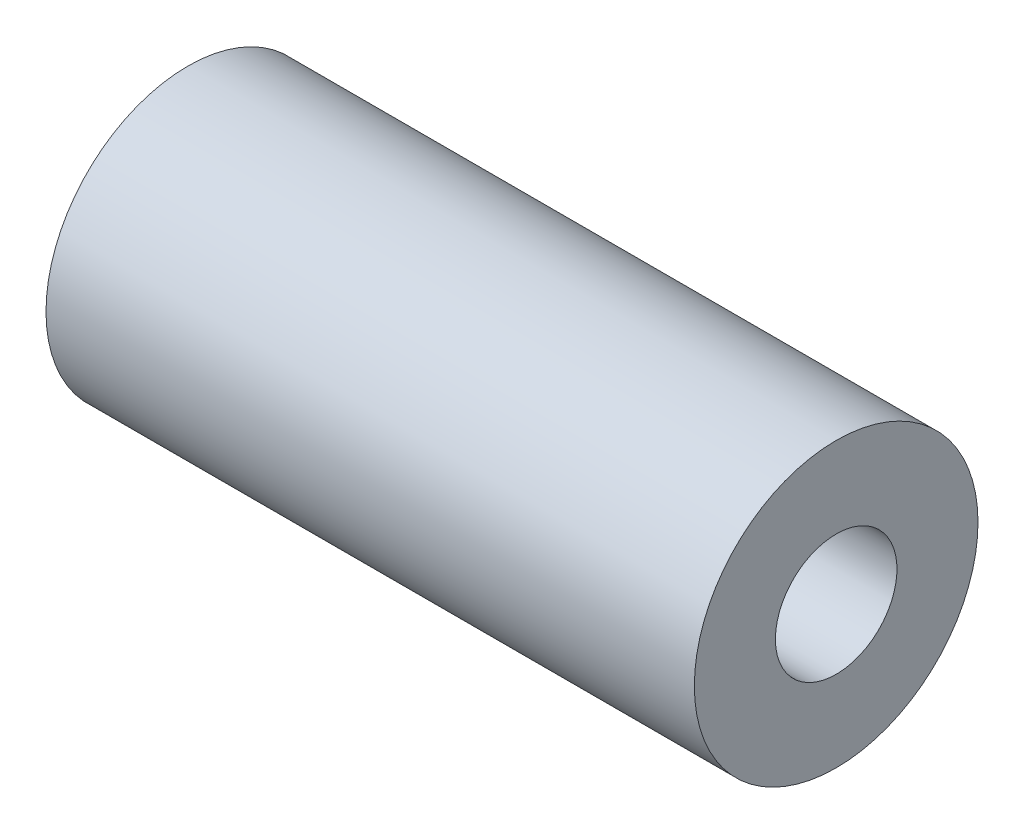
ISO-10303-21;
HEADER;
FILE_DESCRIPTION(('STEP AP214'),'2;1');
FILE_NAME('part.step','',(''),(''),'','','');
FILE_SCHEMA(('AUTOMOTIVE_DESIGN { 1 0 10303 214 1 1 1 1 }'));
ENDSEC;
DATA;
#1=APPLICATION_CONTEXT('core data for automotive mechanical design processes');
#2=APPLICATION_PROTOCOL_DEFINITION('international standard','automotive_design',2000,#1);
#3=PRODUCT_CONTEXT('',#1,'mechanical');
#4=PRODUCT('Part','Part','',(#3));
#5=PRODUCT_RELATED_PRODUCT_CATEGORY('part','',(#4));
#6=PRODUCT_DEFINITION_FORMATION('','',#4);
#7=PRODUCT_DEFINITION_CONTEXT('part definition',#1,'design');
#8=PRODUCT_DEFINITION('design','',#6,#7);
#9=PRODUCT_DEFINITION_SHAPE('','',#8);
#10=(LENGTH_UNIT() NAMED_UNIT(*) SI_UNIT(.MILLI.,.METRE.));
#11=(NAMED_UNIT(*) PLANE_ANGLE_UNIT() SI_UNIT($,.RADIAN.));
#12=(NAMED_UNIT(*) SI_UNIT($,.STERADIAN.) SOLID_ANGLE_UNIT());
#13=UNCERTAINTY_MEASURE_WITH_UNIT(LENGTH_MEASURE(1.E-05),#10,'distance_accuracy_value','');
#14=(GEOMETRIC_REPRESENTATION_CONTEXT(3) GLOBAL_UNCERTAINTY_ASSIGNED_CONTEXT((#13)) GLOBAL_UNIT_ASSIGNED_CONTEXT((#10,
#11,#12)) REPRESENTATION_CONTEXT('',''));
#15=CARTESIAN_POINT('',(0.,0.,0.));
#16=DIRECTION('',(0.,0.,1.));
#17=DIRECTION('',(1.,0.,0.));
#18=AXIS2_PLACEMENT_3D('',#15,#16,#17);
#19=CARTESIAN_POINT('',(-16.,7.,0.));
#20=DIRECTION('',(1.,0.,0.));
#21=DIRECTION('',(0.,0.,-1.));
#22=AXIS2_PLACEMENT_3D('',#19,#20,#21);
#23=PLANE('',#22);
#24=CARTESIAN_POINT('',(-16.,0.,0.));
#25=DIRECTION('',(-1.,0.,0.));
#26=DIRECTION('',(0.,0.,1.));
#27=AXIS2_PLACEMENT_3D('',#24,#25,#26);
#28=CIRCLE('',#27,3.);
#29=CARTESIAN_POINT('',(-16.,0.,3.));
#30=VERTEX_POINT('',#29);
#31=EDGE_CURVE('E10',#30,#30,#28,.T.);
#32=ORIENTED_EDGE('',*,*,#31,.F.);
#33=EDGE_LOOP('',(#32));
#34=FACE_BOUND('',#33,.T.);
#35=CARTESIAN_POINT('',(-16.,0.,0.));
#36=DIRECTION('',(-1.,0.,0.));
#37=DIRECTION('',(0.,0.,1.));
#38=AXIS2_PLACEMENT_3D('',#35,#36,#37);
#39=CIRCLE('',#38,7.);
#40=CARTESIAN_POINT('',(-16.,0.,7.));
#41=VERTEX_POINT('',#40);
#42=EDGE_CURVE('E43',#41,#41,#39,.T.);
#43=ORIENTED_EDGE('',*,*,#42,.T.);
#44=EDGE_LOOP('',(#43));
#45=FACE_BOUND('',#44,.T.);
#46=ADVANCED_FACE('F29',(#34,#45),#23,.F.);
#47=CARTESIAN_POINT('',(-37.0031632185857,0.,0.));
#48=DIRECTION('',(-1.,0.,0.));
#49=DIRECTION('',(0.,0.,1.));
#50=AXIS2_PLACEMENT_3D('',#47,#48,#49);
#51=CYLINDRICAL_SURFACE('',#50,3.);
#52=CARTESIAN_POINT('',(16.,0.,0.));
#53=DIRECTION('',(-1.,0.,0.));
#54=DIRECTION('',(0.,0.,1.));
#55=AXIS2_PLACEMENT_3D('',#52,#53,#54);
#56=CIRCLE('',#55,3.);
#57=CARTESIAN_POINT('',(16.,0.,3.));
#58=VERTEX_POINT('',#57);
#59=EDGE_CURVE('E35',#58,#58,#56,.T.);
#60=ORIENTED_EDGE('',*,*,#59,.F.);
#61=EDGE_LOOP('',(#60));
#62=FACE_BOUND('',#61,.T.);
#63=ORIENTED_EDGE('',*,*,#31,.T.);
#64=EDGE_LOOP('',(#63));
#65=FACE_BOUND('',#64,.T.);
#66=ADVANCED_FACE('F58',(#62,#65),#51,.F.);
#67=CARTESIAN_POINT('',(16.,7.,0.));
#68=DIRECTION('',(-1.,0.,0.));
#69=DIRECTION('',(0.,0.,1.));
#70=AXIS2_PLACEMENT_3D('',#67,#68,#69);
#71=PLANE('',#70);
#72=CARTESIAN_POINT('',(16.,0.,0.));
#73=DIRECTION('',(-1.,0.,0.));
#74=DIRECTION('',(0.,0.,1.));
#75=AXIS2_PLACEMENT_3D('',#72,#73,#74);
#76=CIRCLE('',#75,7.);
#77=CARTESIAN_POINT('',(16.,0.,7.));
#78=VERTEX_POINT('',#77);
#79=EDGE_CURVE('E39',#78,#78,#76,.T.);
#80=ORIENTED_EDGE('',*,*,#79,.F.);
#81=EDGE_LOOP('',(#80));
#82=FACE_BOUND('',#81,.T.);
#83=ORIENTED_EDGE('',*,*,#59,.T.);
#84=EDGE_LOOP('',(#83));
#85=FACE_BOUND('',#84,.T.);
#86=ADVANCED_FACE('F53',(#82,#85),#71,.F.);
#87=CARTESIAN_POINT('',(-37.0031632185857,0.,0.));
#88=DIRECTION('',(-1.,0.,0.));
#89=DIRECTION('',(0.,0.,1.));
#90=AXIS2_PLACEMENT_3D('',#87,#88,#89);
#91=CYLINDRICAL_SURFACE('',#90,7.);
#92=ORIENTED_EDGE('',*,*,#42,.F.);
#93=EDGE_LOOP('',(#92));
#94=FACE_BOUND('',#93,.T.);
#95=ORIENTED_EDGE('',*,*,#79,.T.);
#96=EDGE_LOOP('',(#95));
#97=FACE_BOUND('',#96,.T.);
#98=ADVANCED_FACE('F50',(#94,#97),#91,.T.);
#99=CLOSED_SHELL('',(#46,#66,#86,#98));
#100=MANIFOLD_SOLID_BREP('B2',#99);
#101=ADVANCED_BREP_SHAPE_REPRESENTATION('',(#18,#100),#14);
#102=SHAPE_DEFINITION_REPRESENTATION(#9,#101);
ENDSEC;
END-ISO-10303-21;
